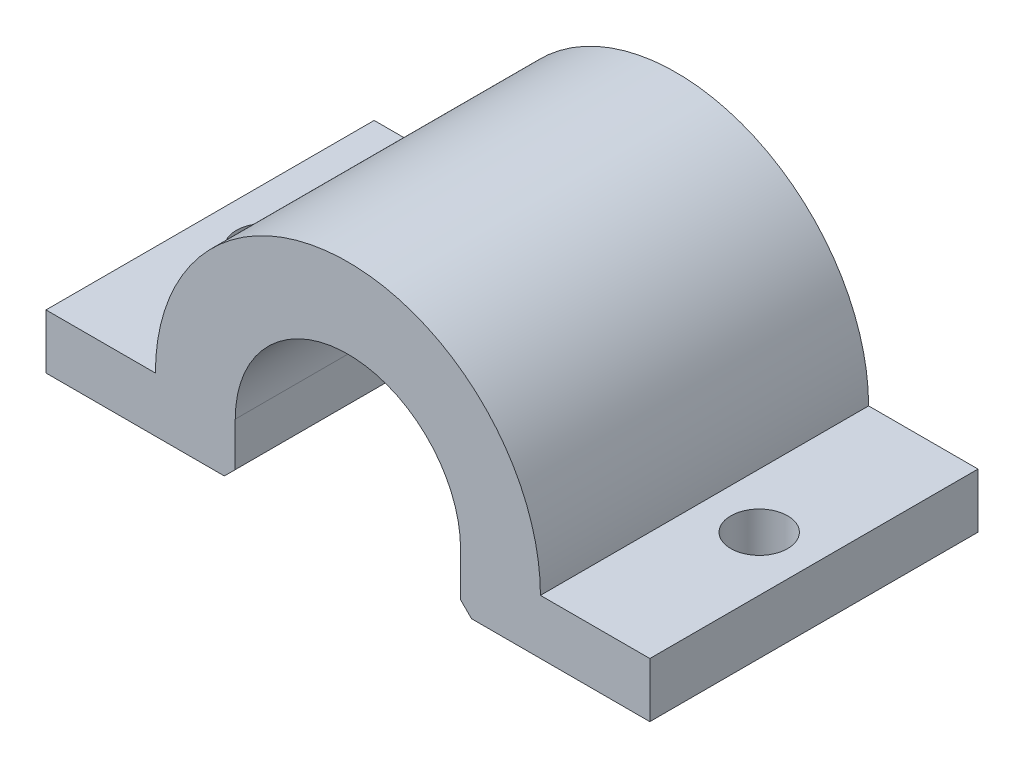
ISO-10303-21;
HEADER;
FILE_DESCRIPTION(('STEP AP214'),'2;1');
FILE_NAME('part.step','',(''),(''),'','','');
FILE_SCHEMA(('AUTOMOTIVE_DESIGN { 1 0 10303 214 1 1 1 1 }'));
ENDSEC;
DATA;
#1=APPLICATION_CONTEXT('core data for automotive mechanical design processes');
#2=APPLICATION_PROTOCOL_DEFINITION('international standard','automotive_design',2000,#1);
#3=PRODUCT_CONTEXT('',#1,'mechanical');
#4=PRODUCT('Part','Part','',(#3));
#5=PRODUCT_RELATED_PRODUCT_CATEGORY('part','',(#4));
#6=PRODUCT_DEFINITION_FORMATION('','',#4);
#7=PRODUCT_DEFINITION_CONTEXT('part definition',#1,'design');
#8=PRODUCT_DEFINITION('design','',#6,#7);
#9=PRODUCT_DEFINITION_SHAPE('','',#8);
#10=(LENGTH_UNIT() NAMED_UNIT(*) SI_UNIT(.MILLI.,.METRE.));
#11=(NAMED_UNIT(*) PLANE_ANGLE_UNIT() SI_UNIT($,.RADIAN.));
#12=(NAMED_UNIT(*) SI_UNIT($,.STERADIAN.) SOLID_ANGLE_UNIT());
#13=UNCERTAINTY_MEASURE_WITH_UNIT(LENGTH_MEASURE(1.E-05),#10,'distance_accuracy_value','');
#14=(GEOMETRIC_REPRESENTATION_CONTEXT(3) GLOBAL_UNCERTAINTY_ASSIGNED_CONTEXT((#13)) GLOBAL_UNIT_ASSIGNED_CONTEXT((#10,
#11,#12)) REPRESENTATION_CONTEXT('',''));
#15=CARTESIAN_POINT('',(0.,0.,0.));
#16=DIRECTION('',(0.,0.,1.));
#17=DIRECTION('',(1.,0.,0.));
#18=AXIS2_PLACEMENT_3D('',#15,#16,#17);
#19=CARTESIAN_POINT('',(0.,0.,30.));
#20=DIRECTION('',(0.,0.,-1.));
#21=DIRECTION('',(-1.,0.,0.));
#22=AXIS2_PLACEMENT_3D('',#19,#20,#21);
#23=CYLINDRICAL_SURFACE('',#22,10.3);
#24=CARTESIAN_POINT('',(0.,0.,0.));
#25=DIRECTION('',(0.,0.,-1.));
#26=DIRECTION('',(-1.,0.,0.));
#27=AXIS2_PLACEMENT_3D('',#24,#25,#26);
#28=CIRCLE('',#27,10.3);
#29=CARTESIAN_POINT('',(-10.3,0.,0.));
#30=VERTEX_POINT('',#29);
#31=CARTESIAN_POINT('',(10.3,0.,0.));
#32=VERTEX_POINT('',#31);
#33=EDGE_CURVE('E153',#30,#32,#28,.T.);
#34=ORIENTED_EDGE('',*,*,#33,.T.);
#35=DIRECTION('',(0.,0.,-1.));
#36=VECTOR('',#35,1.);
#37=CARTESIAN_POINT('',(10.3,0.,30.));
#38=LINE('',#37,#36);
#39=CARTESIAN_POINT('',(10.3,0.,30.));
#40=VERTEX_POINT('',#39);
#41=EDGE_CURVE('E136',#40,#32,#38,.T.);
#42=ORIENTED_EDGE('',*,*,#41,.F.);
#43=CARTESIAN_POINT('',(0.,0.,30.));
#44=DIRECTION('',(0.,0.,-1.));
#45=DIRECTION('',(-1.,0.,0.));
#46=AXIS2_PLACEMENT_3D('',#43,#44,#45);
#47=CIRCLE('',#46,10.3);
#48=CARTESIAN_POINT('',(-10.3,0.,30.));
#49=VERTEX_POINT('',#48);
#50=EDGE_CURVE('E142',#49,#40,#47,.T.);
#51=ORIENTED_EDGE('',*,*,#50,.F.);
#52=DIRECTION('',(0.,0.,-1.));
#53=VECTOR('',#52,1.);
#54=CARTESIAN_POINT('',(-10.3,0.,30.));
#55=LINE('',#54,#53);
#56=EDGE_CURVE('E187',#49,#30,#55,.T.);
#57=ORIENTED_EDGE('',*,*,#56,.T.);
#58=EDGE_LOOP('',(#34,#42,#51,#57));
#59=FACE_BOUND('',#58,.T.);
#60=ADVANCED_FACE('F41',(#59),#23,.F.);
#61=CARTESIAN_POINT('',(10.3,0.,30.));
#62=DIRECTION('',(1.,0.,0.));
#63=DIRECTION('',(0.,0.,-1.));
#64=AXIS2_PLACEMENT_3D('',#61,#62,#63);
#65=PLANE('',#64);
#66=DIRECTION('',(0.,-1.,0.));
#67=VECTOR('',#66,1.);
#68=CARTESIAN_POINT('',(10.3,0.,0.));
#69=LINE('',#68,#67);
#70=CARTESIAN_POINT('',(10.3,-4.,0.));
#71=VERTEX_POINT('',#70);
#72=EDGE_CURVE('E239',#32,#71,#69,.T.);
#73=ORIENTED_EDGE('',*,*,#72,.T.);
#74=DIRECTION('',(0.,0.,1.));
#75=VECTOR('',#74,1.);
#76=CARTESIAN_POINT('',(10.3,-4.,30.));
#77=LINE('',#76,#75);
#78=CARTESIAN_POINT('',(10.3,-4.,30.));
#79=VERTEX_POINT('',#78);
#80=EDGE_CURVE('E139',#71,#79,#77,.T.);
#81=ORIENTED_EDGE('',*,*,#80,.T.);
#82=DIRECTION('',(0.,-1.,0.));
#83=VECTOR('',#82,1.);
#84=CARTESIAN_POINT('',(10.3,0.,30.));
#85=LINE('',#84,#83);
#86=EDGE_CURVE('E131',#40,#79,#85,.T.);
#87=ORIENTED_EDGE('',*,*,#86,.F.);
#88=ORIENTED_EDGE('',*,*,#41,.T.);
#89=EDGE_LOOP('',(#73,#81,#87,#88));
#90=FACE_BOUND('',#89,.T.);
#91=ADVANCED_FACE('F134',(#90),#65,.F.);
#92=CARTESIAN_POINT('',(10.3,-5.,30.));
#93=DIRECTION('',(0.,1.,0.));
#94=DIRECTION('',(0.,0.,1.));
#95=AXIS2_PLACEMENT_3D('',#92,#93,#94);
#96=PLANE('',#95);
#97=CARTESIAN_POINT('',(22.6,-5.,15.));
#98=DIRECTION('',(0.,1.,0.));
#99=DIRECTION('',(-1.,0.,0.));
#100=AXIS2_PLACEMENT_3D('',#97,#98,#99);
#101=CIRCLE('',#100,2.6);
#102=CARTESIAN_POINT('',(20.,-5.,15.));
#103=VERTEX_POINT('',#102);
#104=EDGE_CURVE('E393',#103,#103,#101,.T.);
#105=ORIENTED_EDGE('',*,*,#104,.T.);
#106=EDGE_LOOP('',(#105));
#107=FACE_BOUND('',#106,.T.);
#108=DIRECTION('',(1.,0.,0.));
#109=VECTOR('',#108,1.);
#110=CARTESIAN_POINT('',(10.3,-5.,30.));
#111=LINE('',#110,#109);
#112=CARTESIAN_POINT('',(11.3,-5.,30.));
#113=VERTEX_POINT('',#112);
#114=CARTESIAN_POINT('',(27.6,-5.,30.));
#115=VERTEX_POINT('',#114);
#116=EDGE_CURVE('E141',#113,#115,#111,.T.);
#117=ORIENTED_EDGE('',*,*,#116,.F.);
#118=DIRECTION('',(0.,0.,-1.));
#119=VECTOR('',#118,1.);
#120=CARTESIAN_POINT('',(11.3,-5.,30.));
#121=LINE('',#120,#119);
#122=CARTESIAN_POINT('',(11.3,-5.,0.));
#123=VERTEX_POINT('',#122);
#124=EDGE_CURVE('E154',#113,#123,#121,.T.);
#125=ORIENTED_EDGE('',*,*,#124,.T.);
#126=DIRECTION('',(1.,0.,0.));
#127=VECTOR('',#126,1.);
#128=CARTESIAN_POINT('',(10.3,-5.,0.));
#129=LINE('',#128,#127);
#130=CARTESIAN_POINT('',(27.6,-5.,0.));
#131=VERTEX_POINT('',#130);
#132=EDGE_CURVE('E219',#123,#131,#129,.T.);
#133=ORIENTED_EDGE('',*,*,#132,.T.);
#134=DIRECTION('',(0.,0.,-1.));
#135=VECTOR('',#134,1.);
#136=CARTESIAN_POINT('',(27.6,-5.,30.));
#137=LINE('',#136,#135);
#138=EDGE_CURVE('E155',#115,#131,#137,.T.);
#139=ORIENTED_EDGE('',*,*,#138,.F.);
#140=EDGE_LOOP('',(#117,#125,#133,#139));
#141=FACE_BOUND('',#140,.T.);
#142=ADVANCED_FACE('F244',(#107,#141),#96,.F.);
#143=CARTESIAN_POINT('',(27.6,0.,30.));
#144=DIRECTION('',(-1.,0.,0.));
#145=DIRECTION('',(0.,0.,1.));
#146=AXIS2_PLACEMENT_3D('',#143,#144,#145);
#147=PLANE('',#146);
#148=DIRECTION('',(0.,1.,0.));
#149=VECTOR('',#148,1.);
#150=CARTESIAN_POINT('',(27.6,0.,0.));
#151=LINE('',#150,#149);
#152=CARTESIAN_POINT('',(27.6,0.,0.));
#153=VERTEX_POINT('',#152);
#154=EDGE_CURVE('E213',#131,#153,#151,.T.);
#155=ORIENTED_EDGE('',*,*,#154,.T.);
#156=DIRECTION('',(0.,0.,-1.));
#157=VECTOR('',#156,1.);
#158=CARTESIAN_POINT('',(27.6,0.,30.));
#159=LINE('',#158,#157);
#160=CARTESIAN_POINT('',(27.6,0.,30.));
#161=VERTEX_POINT('',#160);
#162=EDGE_CURVE('E161',#161,#153,#159,.T.);
#163=ORIENTED_EDGE('',*,*,#162,.F.);
#164=DIRECTION('',(0.,1.,0.));
#165=VECTOR('',#164,1.);
#166=CARTESIAN_POINT('',(27.6,0.,30.));
#167=LINE('',#166,#165);
#168=EDGE_CURVE('E247',#115,#161,#167,.T.);
#169=ORIENTED_EDGE('',*,*,#168,.F.);
#170=ORIENTED_EDGE('',*,*,#138,.T.);
#171=EDGE_LOOP('',(#155,#163,#169,#170));
#172=FACE_BOUND('',#171,.T.);
#173=ADVANCED_FACE('F246',(#172),#147,.F.);
#174=CARTESIAN_POINT('',(17.6,0.,30.));
#175=DIRECTION('',(0.,-1.,0.));
#176=DIRECTION('',(0.,0.,-1.));
#177=AXIS2_PLACEMENT_3D('',#174,#175,#176);
#178=PLANE('',#177);
#179=CARTESIAN_POINT('',(22.6,0.,15.));
#180=DIRECTION('',(0.,1.,0.));
#181=DIRECTION('',(-1.,0.,0.));
#182=AXIS2_PLACEMENT_3D('',#179,#180,#181);
#183=CIRCLE('',#182,2.6);
#184=CARTESIAN_POINT('',(20.,0.,15.));
#185=VERTEX_POINT('',#184);
#186=EDGE_CURVE('E395',#185,#185,#183,.T.);
#187=ORIENTED_EDGE('',*,*,#186,.F.);
#188=EDGE_LOOP('',(#187));
#189=FACE_BOUND('',#188,.T.);
#190=DIRECTION('',(-1.,0.,0.));
#191=VECTOR('',#190,1.);
#192=CARTESIAN_POINT('',(17.6,0.,0.));
#193=LINE('',#192,#191);
#194=CARTESIAN_POINT('',(17.6,0.,0.));
#195=VERTEX_POINT('',#194);
#196=EDGE_CURVE('E207',#153,#195,#193,.T.);
#197=ORIENTED_EDGE('',*,*,#196,.T.);
#198=DIRECTION('',(0.,0.,-1.));
#199=VECTOR('',#198,1.);
#200=CARTESIAN_POINT('',(17.6,0.,30.));
#201=LINE('',#200,#199);
#202=CARTESIAN_POINT('',(17.6,0.,30.));
#203=VERTEX_POINT('',#202);
#204=EDGE_CURVE('E198',#203,#195,#201,.T.);
#205=ORIENTED_EDGE('',*,*,#204,.F.);
#206=DIRECTION('',(-1.,0.,0.));
#207=VECTOR('',#206,1.);
#208=CARTESIAN_POINT('',(17.6,0.,30.));
#209=LINE('',#208,#207);
#210=EDGE_CURVE('E208',#161,#203,#209,.T.);
#211=ORIENTED_EDGE('',*,*,#210,.F.);
#212=ORIENTED_EDGE('',*,*,#162,.T.);
#213=EDGE_LOOP('',(#197,#205,#211,#212));
#214=FACE_BOUND('',#213,.T.);
#215=ADVANCED_FACE('F205',(#189,#214),#178,.F.);
#216=CARTESIAN_POINT('',(0.,0.,30.));
#217=DIRECTION('',(0.,0.,-1.));
#218=DIRECTION('',(-1.,0.,0.));
#219=AXIS2_PLACEMENT_3D('',#216,#217,#218);
#220=CYLINDRICAL_SURFACE('',#219,17.6);
#221=CARTESIAN_POINT('',(0.,0.,0.));
#222=DIRECTION('',(0.,0.,1.));
#223=DIRECTION('',(-1.,0.,0.));
#224=AXIS2_PLACEMENT_3D('',#221,#222,#223);
#225=CIRCLE('',#224,17.6);
#226=CARTESIAN_POINT('',(-17.6,0.,0.));
#227=VERTEX_POINT('',#226);
#228=EDGE_CURVE('E215',#195,#227,#225,.T.);
#229=ORIENTED_EDGE('',*,*,#228,.T.);
#230=DIRECTION('',(0.,0.,-1.));
#231=VECTOR('',#230,1.);
#232=CARTESIAN_POINT('',(-17.6,0.,30.));
#233=LINE('',#232,#231);
#234=CARTESIAN_POINT('',(-17.6,0.,30.));
#235=VERTEX_POINT('',#234);
#236=EDGE_CURVE('E195',#235,#227,#233,.T.);
#237=ORIENTED_EDGE('',*,*,#236,.F.);
#238=CARTESIAN_POINT('',(0.,0.,30.));
#239=DIRECTION('',(0.,0.,1.));
#240=DIRECTION('',(-1.,0.,0.));
#241=AXIS2_PLACEMENT_3D('',#238,#239,#240);
#242=CIRCLE('',#241,17.6);
#243=EDGE_CURVE('E249',#203,#235,#242,.T.);
#244=ORIENTED_EDGE('',*,*,#243,.F.);
#245=ORIENTED_EDGE('',*,*,#204,.T.);
#246=EDGE_LOOP('',(#229,#237,#244,#245));
#247=FACE_BOUND('',#246,.T.);
#248=ADVANCED_FACE('F259',(#247),#220,.T.);
#249=CARTESIAN_POINT('',(-27.6,0.,30.));
#250=DIRECTION('',(0.,-1.,0.));
#251=DIRECTION('',(1.,0.,0.));
#252=AXIS2_PLACEMENT_3D('',#249,#250,#251);
#253=PLANE('',#252);
#254=CARTESIAN_POINT('',(-22.6,0.,15.));
#255=DIRECTION('',(0.,1.,0.));
#256=DIRECTION('',(-1.,0.,0.));
#257=AXIS2_PLACEMENT_3D('',#254,#255,#256);
#258=CIRCLE('',#257,2.6);
#259=CARTESIAN_POINT('',(-25.2,0.,15.));
#260=VERTEX_POINT('',#259);
#261=EDGE_CURVE('E394',#260,#260,#258,.T.);
#262=ORIENTED_EDGE('',*,*,#261,.F.);
#263=EDGE_LOOP('',(#262));
#264=FACE_BOUND('',#263,.T.);
#265=DIRECTION('',(-1.,0.,0.));
#266=VECTOR('',#265,1.);
#267=CARTESIAN_POINT('',(-27.6,0.,0.));
#268=LINE('',#267,#266);
#269=CARTESIAN_POINT('',(-27.6,0.,0.));
#270=VERTEX_POINT('',#269);
#271=EDGE_CURVE('E217',#227,#270,#268,.T.);
#272=ORIENTED_EDGE('',*,*,#271,.T.);
#273=DIRECTION('',(0.,0.,-1.));
#274=VECTOR('',#273,1.);
#275=CARTESIAN_POINT('',(-27.6,0.,30.));
#276=LINE('',#275,#274);
#277=CARTESIAN_POINT('',(-27.6,0.,30.));
#278=VERTEX_POINT('',#277);
#279=EDGE_CURVE('E192',#278,#270,#276,.T.);
#280=ORIENTED_EDGE('',*,*,#279,.F.);
#281=DIRECTION('',(-1.,0.,0.));
#282=VECTOR('',#281,1.);
#283=CARTESIAN_POINT('',(-27.6,0.,30.));
#284=LINE('',#283,#282);
#285=EDGE_CURVE('E234',#235,#278,#284,.T.);
#286=ORIENTED_EDGE('',*,*,#285,.F.);
#287=ORIENTED_EDGE('',*,*,#236,.T.);
#288=EDGE_LOOP('',(#272,#280,#286,#287));
#289=FACE_BOUND('',#288,.T.);
#290=ADVANCED_FACE('F257',(#264,#289),#253,.F.);
#291=CARTESIAN_POINT('',(-27.6,0.,30.));
#292=DIRECTION('',(1.,0.,0.));
#293=DIRECTION('',(0.,0.,-1.));
#294=AXIS2_PLACEMENT_3D('',#291,#292,#293);
#295=PLANE('',#294);
#296=DIRECTION('',(0.,-1.,0.));
#297=VECTOR('',#296,1.);
#298=CARTESIAN_POINT('',(-27.6,0.,0.));
#299=LINE('',#298,#297);
#300=CARTESIAN_POINT('',(-27.6,-5.,0.));
#301=VERTEX_POINT('',#300);
#302=EDGE_CURVE('E183',#270,#301,#299,.T.);
#303=ORIENTED_EDGE('',*,*,#302,.T.);
#304=DIRECTION('',(0.,0.,-1.));
#305=VECTOR('',#304,1.);
#306=CARTESIAN_POINT('',(-27.6,-5.,30.));
#307=LINE('',#306,#305);
#308=CARTESIAN_POINT('',(-27.6,-5.,30.));
#309=VERTEX_POINT('',#308);
#310=EDGE_CURVE('E189',#309,#301,#307,.T.);
#311=ORIENTED_EDGE('',*,*,#310,.F.);
#312=DIRECTION('',(0.,-1.,0.));
#313=VECTOR('',#312,1.);
#314=CARTESIAN_POINT('',(-27.6,0.,30.));
#315=LINE('',#314,#313);
#316=EDGE_CURVE('E231',#278,#309,#315,.T.);
#317=ORIENTED_EDGE('',*,*,#316,.F.);
#318=ORIENTED_EDGE('',*,*,#279,.T.);
#319=EDGE_LOOP('',(#303,#311,#317,#318));
#320=FACE_BOUND('',#319,.T.);
#321=ADVANCED_FACE('F226',(#320),#295,.F.);
#322=CARTESIAN_POINT('',(-10.3,-5.,30.));
#323=DIRECTION('',(0.,1.,0.));
#324=DIRECTION('',(-1.,0.,0.));
#325=AXIS2_PLACEMENT_3D('',#322,#323,#324);
#326=PLANE('',#325);
#327=CARTESIAN_POINT('',(-22.6,-5.00000000000001,15.));
#328=DIRECTION('',(0.,1.,0.));
#329=DIRECTION('',(-1.,0.,0.));
#330=AXIS2_PLACEMENT_3D('',#327,#328,#329);
#331=CIRCLE('',#330,2.6);
#332=CARTESIAN_POINT('',(-25.2,-5.00000000000001,15.));
#333=VERTEX_POINT('',#332);
#334=EDGE_CURVE('E240',#333,#333,#331,.T.);
#335=ORIENTED_EDGE('',*,*,#334,.T.);
#336=EDGE_LOOP('',(#335));
#337=FACE_BOUND('',#336,.T.);
#338=DIRECTION('',(1.,0.,0.));
#339=VECTOR('',#338,1.);
#340=CARTESIAN_POINT('',(-10.3,-5.,0.));
#341=LINE('',#340,#339);
#342=CARTESIAN_POINT('',(-11.3,-5.,0.));
#343=VERTEX_POINT('',#342);
#344=EDGE_CURVE('E181',#301,#343,#341,.T.);
#345=ORIENTED_EDGE('',*,*,#344,.T.);
#346=DIRECTION('',(0.,0.,1.));
#347=VECTOR('',#346,1.);
#348=CARTESIAN_POINT('',(-11.3,-5.,30.));
#349=LINE('',#348,#347);
#350=CARTESIAN_POINT('',(-11.3,-5.,30.));
#351=VERTEX_POINT('',#350);
#352=EDGE_CURVE('E11',#343,#351,#349,.T.);
#353=ORIENTED_EDGE('',*,*,#352,.T.);
#354=DIRECTION('',(1.,0.,0.));
#355=VECTOR('',#354,1.);
#356=CARTESIAN_POINT('',(-10.3,-5.,30.));
#357=LINE('',#356,#355);
#358=EDGE_CURVE('E230',#309,#351,#357,.T.);
#359=ORIENTED_EDGE('',*,*,#358,.F.);
#360=ORIENTED_EDGE('',*,*,#310,.T.);
#361=EDGE_LOOP('',(#345,#353,#359,#360));
#362=FACE_BOUND('',#361,.T.);
#363=ADVANCED_FACE('F229',(#337,#362),#326,.F.);
#364=CARTESIAN_POINT('',(-10.3,0.,30.));
#365=DIRECTION('',(-1.,0.,0.));
#366=DIRECTION('',(0.,0.,1.));
#367=AXIS2_PLACEMENT_3D('',#364,#365,#366);
#368=PLANE('',#367);
#369=DIRECTION('',(0.,1.,0.));
#370=VECTOR('',#369,1.);
#371=CARTESIAN_POINT('',(-10.3,0.,30.));
#372=LINE('',#371,#370);
#373=CARTESIAN_POINT('',(-10.3,-4.00000000000002,30.));
#374=VERTEX_POINT('',#373);
#375=EDGE_CURVE('E146',#374,#49,#372,.T.);
#376=ORIENTED_EDGE('',*,*,#375,.F.);
#377=DIRECTION('',(0.,0.,-1.));
#378=VECTOR('',#377,1.);
#379=CARTESIAN_POINT('',(-10.3,-4.00000000000002,30.));
#380=LINE('',#379,#378);
#381=CARTESIAN_POINT('',(-10.3,-4.00000000000002,0.));
#382=VERTEX_POINT('',#381);
#383=EDGE_CURVE('E50',#374,#382,#380,.T.);
#384=ORIENTED_EDGE('',*,*,#383,.T.);
#385=DIRECTION('',(0.,1.,0.));
#386=VECTOR('',#385,1.);
#387=CARTESIAN_POINT('',(-10.3,0.,0.));
#388=LINE('',#387,#386);
#389=EDGE_CURVE('E150',#382,#30,#388,.T.);
#390=ORIENTED_EDGE('',*,*,#389,.T.);
#391=ORIENTED_EDGE('',*,*,#56,.F.);
#392=EDGE_LOOP('',(#376,#384,#390,#391));
#393=FACE_BOUND('',#392,.T.);
#394=ADVANCED_FACE('F175',(#393),#368,.F.);
#395=CARTESIAN_POINT('',(0.,0.,30.));
#396=DIRECTION('',(0.,0.,-1.));
#397=DIRECTION('',(-1.,0.,0.));
#398=AXIS2_PLACEMENT_3D('',#395,#396,#397);
#399=PLANE('',#398);
#400=ORIENTED_EDGE('',*,*,#86,.T.);
#401=DIRECTION('',(-0.707106781186545,0.70710678118655,0.));
#402=VECTOR('',#401,1.);
#403=CARTESIAN_POINT('',(11.3,-5.,30.));
#404=LINE('',#403,#402);
#405=EDGE_CURVE('E170',#79,#113,#404,.F.);
#406=ORIENTED_EDGE('',*,*,#405,.T.);
#407=ORIENTED_EDGE('',*,*,#116,.T.);
#408=ORIENTED_EDGE('',*,*,#168,.T.);
#409=ORIENTED_EDGE('',*,*,#210,.T.);
#410=ORIENTED_EDGE('',*,*,#243,.T.);
#411=ORIENTED_EDGE('',*,*,#285,.T.);
#412=ORIENTED_EDGE('',*,*,#316,.T.);
#413=ORIENTED_EDGE('',*,*,#358,.T.);
#414=DIRECTION('',(-0.70710678118655,-0.707106781186545,0.));
#415=VECTOR('',#414,1.);
#416=CARTESIAN_POINT('',(-10.3,-4.00000000000002,30.));
#417=LINE('',#416,#415);
#418=EDGE_CURVE('E57',#351,#374,#417,.F.);
#419=ORIENTED_EDGE('',*,*,#418,.T.);
#420=ORIENTED_EDGE('',*,*,#375,.T.);
#421=ORIENTED_EDGE('',*,*,#50,.T.);
#422=EDGE_LOOP('',(#400,#406,#407,#408,#409,#410,#411,#412,#413,#419,#420,#421));
#423=FACE_BOUND('',#422,.T.);
#424=ADVANCED_FACE('F145',(#423),#399,.F.);
#425=CARTESIAN_POINT('',(0.,0.,0.));
#426=DIRECTION('',(0.,0.,-1.));
#427=DIRECTION('',(-1.,0.,0.));
#428=AXIS2_PLACEMENT_3D('',#425,#426,#427);
#429=PLANE('',#428);
#430=ORIENTED_EDGE('',*,*,#132,.F.);
#431=DIRECTION('',(0.707106781186545,-0.70710678118655,0.));
#432=VECTOR('',#431,1.);
#433=CARTESIAN_POINT('',(3.15000000000004,3.15000000000002,0.));
#434=LINE('',#433,#432);
#435=EDGE_CURVE('E166',#123,#71,#434,.F.);
#436=ORIENTED_EDGE('',*,*,#435,.T.);
#437=ORIENTED_EDGE('',*,*,#72,.F.);
#438=ORIENTED_EDGE('',*,*,#33,.F.);
#439=ORIENTED_EDGE('',*,*,#389,.F.);
#440=DIRECTION('',(0.70710678118655,0.707106781186545,0.));
#441=VECTOR('',#440,1.);
#442=CARTESIAN_POINT('',(-3.14999999999995,3.14999999999998,0.));
#443=LINE('',#442,#441);
#444=EDGE_CURVE('E158',#382,#343,#443,.F.);
#445=ORIENTED_EDGE('',*,*,#444,.T.);
#446=ORIENTED_EDGE('',*,*,#344,.F.);
#447=ORIENTED_EDGE('',*,*,#302,.F.);
#448=ORIENTED_EDGE('',*,*,#271,.F.);
#449=ORIENTED_EDGE('',*,*,#228,.F.);
#450=ORIENTED_EDGE('',*,*,#196,.F.);
#451=ORIENTED_EDGE('',*,*,#154,.F.);
#452=EDGE_LOOP('',(#430,#436,#437,#438,#439,#445,#446,#447,#448,#449,#450,#451));
#453=FACE_BOUND('',#452,.T.);
#454=ADVANCED_FACE('F179',(#453),#429,.T.);
#455=CARTESIAN_POINT('',(-22.6,-5.00000000000001,15.));
#456=DIRECTION('',(0.,1.,0.));
#457=DIRECTION('',(-1.,0.,0.));
#458=AXIS2_PLACEMENT_3D('',#455,#456,#457);
#459=CYLINDRICAL_SURFACE('',#458,2.6);
#460=ORIENTED_EDGE('',*,*,#334,.F.);
#461=EDGE_LOOP('',(#460));
#462=FACE_BOUND('',#461,.T.);
#463=ORIENTED_EDGE('',*,*,#261,.T.);
#464=EDGE_LOOP('',(#463));
#465=FACE_BOUND('',#464,.T.);
#466=ADVANCED_FACE('F288',(#462,#465),#459,.F.);
#467=CARTESIAN_POINT('',(22.6,-5.,15.));
#468=DIRECTION('',(0.,1.,0.));
#469=DIRECTION('',(-1.,0.,0.));
#470=AXIS2_PLACEMENT_3D('',#467,#468,#469);
#471=CYLINDRICAL_SURFACE('',#470,2.6);
#472=ORIENTED_EDGE('',*,*,#104,.F.);
#473=EDGE_LOOP('',(#472));
#474=FACE_BOUND('',#473,.T.);
#475=ORIENTED_EDGE('',*,*,#186,.T.);
#476=EDGE_LOOP('',(#475));
#477=FACE_BOUND('',#476,.T.);
#478=ADVANCED_FACE('F282',(#474,#477),#471,.F.);
#479=CARTESIAN_POINT('',(11.3,-5.,30.));
#480=DIRECTION('',(0.70710678118655,0.707106781186545,0.));
#481=DIRECTION('',(0.,0.,-1.));
#482=AXIS2_PLACEMENT_3D('',#479,#480,#481);
#483=PLANE('',#482);
#484=ORIENTED_EDGE('',*,*,#405,.F.);
#485=ORIENTED_EDGE('',*,*,#80,.F.);
#486=ORIENTED_EDGE('',*,*,#435,.F.);
#487=ORIENTED_EDGE('',*,*,#124,.F.);
#488=EDGE_LOOP('',(#484,#485,#486,#487));
#489=FACE_BOUND('',#488,.T.);
#490=ADVANCED_FACE('F278',(#489),#483,.F.);
#491=CARTESIAN_POINT('',(-10.3,-4.00000000000002,30.));
#492=DIRECTION('',(-0.707106781186545,0.70710678118655,0.));
#493=DIRECTION('',(0.,0.,-1.));
#494=AXIS2_PLACEMENT_3D('',#491,#492,#493);
#495=PLANE('',#494);
#496=ORIENTED_EDGE('',*,*,#418,.F.);
#497=ORIENTED_EDGE('',*,*,#352,.F.);
#498=ORIENTED_EDGE('',*,*,#444,.F.);
#499=ORIENTED_EDGE('',*,*,#383,.F.);
#500=EDGE_LOOP('',(#496,#497,#498,#499));
#501=FACE_BOUND('',#500,.T.);
#502=ADVANCED_FACE('F44',(#501),#495,.F.);
#503=CLOSED_SHELL('',(#60,#91,#142,#173,#215,#248,#290,#321,#363,#394,#424,#454,#466,#478,#490,#502));
#504=MANIFOLD_SOLID_BREP('B2',#503);
#505=ADVANCED_BREP_SHAPE_REPRESENTATION('',(#18,#504),#14);
#506=SHAPE_DEFINITION_REPRESENTATION(#9,#505);
ENDSEC;
END-ISO-10303-21;
